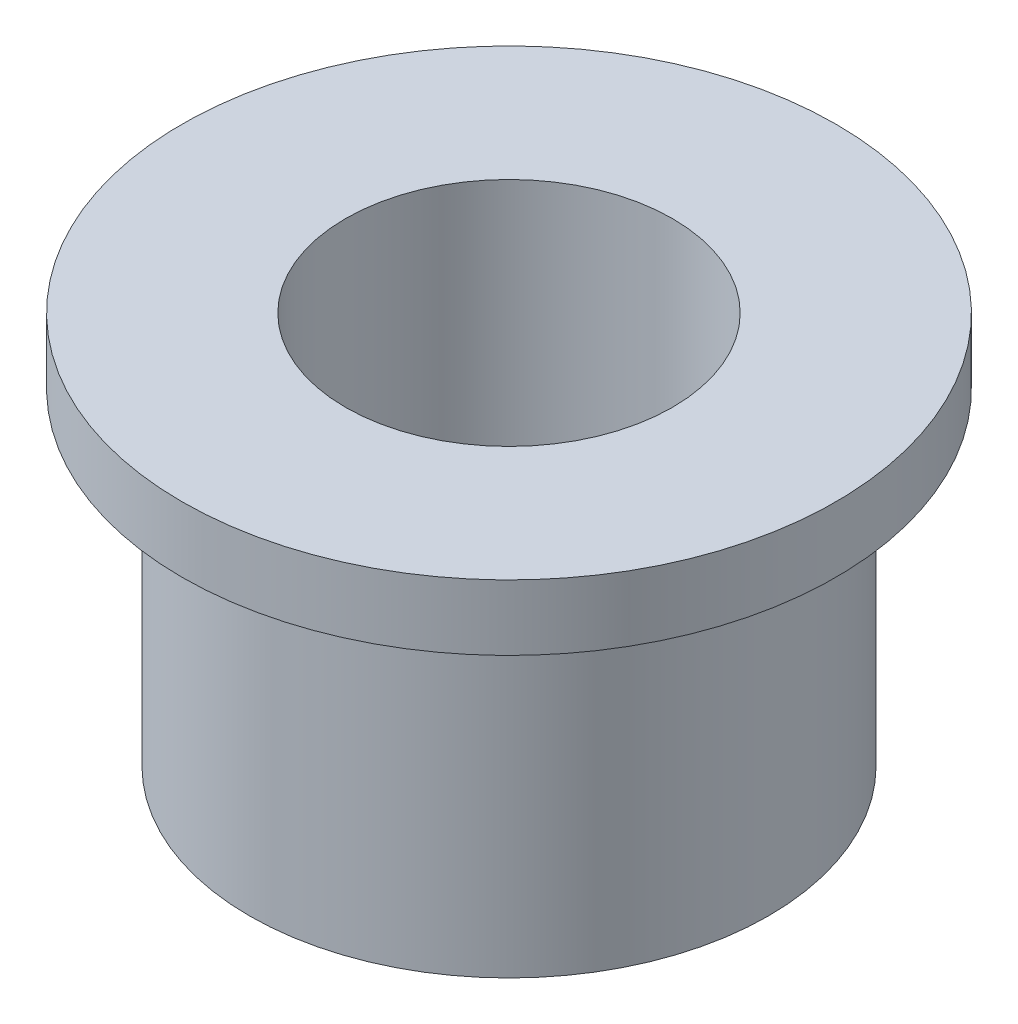
ISO-10303-21;
HEADER;
FILE_DESCRIPTION(('STEP AP214'),'2;1');
FILE_NAME('part.step','',(''),(''),'','','');
FILE_SCHEMA(('AUTOMOTIVE_DESIGN { 1 0 10303 214 1 1 1 1 }'));
ENDSEC;
DATA;
#1=APPLICATION_CONTEXT('core data for automotive mechanical design processes');
#2=APPLICATION_PROTOCOL_DEFINITION('international standard','automotive_design',2000,#1);
#3=PRODUCT_CONTEXT('',#1,'mechanical');
#4=PRODUCT('Part','Part','',(#3));
#5=PRODUCT_RELATED_PRODUCT_CATEGORY('part','',(#4));
#6=PRODUCT_DEFINITION_FORMATION('','',#4);
#7=PRODUCT_DEFINITION_CONTEXT('part definition',#1,'design');
#8=PRODUCT_DEFINITION('design','',#6,#7);
#9=PRODUCT_DEFINITION_SHAPE('','',#8);
#10=(LENGTH_UNIT() NAMED_UNIT(*) SI_UNIT(.MILLI.,.METRE.));
#11=(NAMED_UNIT(*) PLANE_ANGLE_UNIT() SI_UNIT($,.RADIAN.));
#12=(NAMED_UNIT(*) SI_UNIT($,.STERADIAN.) SOLID_ANGLE_UNIT());
#13=UNCERTAINTY_MEASURE_WITH_UNIT(LENGTH_MEASURE(1.E-05),#10,'distance_accuracy_value','');
#14=(GEOMETRIC_REPRESENTATION_CONTEXT(3) GLOBAL_UNCERTAINTY_ASSIGNED_CONTEXT((#13)) GLOBAL_UNIT_ASSIGNED_CONTEXT((#10,
#11,#12)) REPRESENTATION_CONTEXT('',''));
#15=CARTESIAN_POINT('',(0.,0.,0.));
#16=DIRECTION('',(0.,0.,1.));
#17=DIRECTION('',(1.,0.,0.));
#18=AXIS2_PLACEMENT_3D('',#15,#16,#17);
#19=CARTESIAN_POINT('',(10.,1.03225806451612,0.));
#20=DIRECTION('',(0.,-1.,0.));
#21=DIRECTION('',(0.,0.,-1.));
#22=AXIS2_PLACEMENT_3D('',#19,#20,#21);
#23=PLANE('',#22);
#24=CARTESIAN_POINT('',(0.,1.03225806451612,0.));
#25=DIRECTION('',(0.,1.,0.));
#26=DIRECTION('',(0.,0.,1.));
#27=AXIS2_PLACEMENT_3D('',#24,#25,#26);
#28=CIRCLE('',#27,5.);
#29=CARTESIAN_POINT('',(0.,1.03225806451612,5.));
#30=VERTEX_POINT('',#29);
#31=EDGE_CURVE('E10',#30,#30,#28,.T.);
#32=ORIENTED_EDGE('',*,*,#31,.F.);
#33=EDGE_LOOP('',(#32));
#34=FACE_BOUND('',#33,.T.);
#35=CARTESIAN_POINT('',(0.,1.03225806451612,0.));
#36=DIRECTION('',(0.,1.,0.));
#37=DIRECTION('',(0.,0.,1.));
#38=AXIS2_PLACEMENT_3D('',#35,#36,#37);
#39=CIRCLE('',#38,10.);
#40=CARTESIAN_POINT('',(0.,1.03225806451612,10.));
#41=VERTEX_POINT('',#40);
#42=EDGE_CURVE('E65',#41,#41,#39,.T.);
#43=ORIENTED_EDGE('',*,*,#42,.T.);
#44=EDGE_LOOP('',(#43));
#45=FACE_BOUND('',#44,.T.);
#46=ADVANCED_FACE('F36',(#34,#45),#23,.F.);
#47=CARTESIAN_POINT('',(0.,0.,0.));
#48=DIRECTION('',(0.,1.,0.));
#49=DIRECTION('',(0.,0.,1.));
#50=AXIS2_PLACEMENT_3D('',#47,#48,#49);
#51=CYLINDRICAL_SURFACE('',#50,5.);
#52=CARTESIAN_POINT('',(0.,-10.9677419354839,0.));
#53=DIRECTION('',(0.,1.,0.));
#54=DIRECTION('',(0.,0.,1.));
#55=AXIS2_PLACEMENT_3D('',#52,#53,#54);
#56=CIRCLE('',#55,5.);
#57=CARTESIAN_POINT('',(0.,-10.9677419354839,5.));
#58=VERTEX_POINT('',#57);
#59=EDGE_CURVE('E43',#58,#58,#56,.T.);
#60=ORIENTED_EDGE('',*,*,#59,.F.);
#61=EDGE_LOOP('',(#60));
#62=FACE_BOUND('',#61,.T.);
#63=ORIENTED_EDGE('',*,*,#31,.T.);
#64=EDGE_LOOP('',(#63));
#65=FACE_BOUND('',#64,.T.);
#66=ADVANCED_FACE('F92',(#62,#65),#51,.F.);
#67=CARTESIAN_POINT('',(5.,-10.9677419354839,0.));
#68=DIRECTION('',(0.,1.,0.));
#69=DIRECTION('',(0.,0.,1.));
#70=AXIS2_PLACEMENT_3D('',#67,#68,#69);
#71=PLANE('',#70);
#72=CARTESIAN_POINT('',(0.,-10.9677419354839,0.));
#73=DIRECTION('',(0.,1.,0.));
#74=DIRECTION('',(0.,0.,1.));
#75=AXIS2_PLACEMENT_3D('',#72,#73,#74);
#76=CIRCLE('',#75,7.9375);
#77=CARTESIAN_POINT('',(0.,-10.9677419354839,7.9375));
#78=VERTEX_POINT('',#77);
#79=EDGE_CURVE('E49',#78,#78,#76,.T.);
#80=ORIENTED_EDGE('',*,*,#79,.F.);
#81=EDGE_LOOP('',(#80));
#82=FACE_BOUND('',#81,.T.);
#83=ORIENTED_EDGE('',*,*,#59,.T.);
#84=EDGE_LOOP('',(#83));
#85=FACE_BOUND('',#84,.T.);
#86=ADVANCED_FACE('F87',(#82,#85),#71,.F.);
#87=CARTESIAN_POINT('',(0.,0.,0.));
#88=DIRECTION('',(0.,1.,0.));
#89=DIRECTION('',(0.,0.,1.));
#90=AXIS2_PLACEMENT_3D('',#87,#88,#89);
#91=CYLINDRICAL_SURFACE('',#90,7.9375);
#92=CARTESIAN_POINT('',(0.,-0.967741935483877,0.));
#93=DIRECTION('',(0.,1.,0.));
#94=DIRECTION('',(0.,0.,1.));
#95=AXIS2_PLACEMENT_3D('',#92,#93,#94);
#96=CIRCLE('',#95,7.9375);
#97=CARTESIAN_POINT('',(0.,-0.967741935483877,7.9375));
#98=VERTEX_POINT('',#97);
#99=EDGE_CURVE('E55',#98,#98,#96,.T.);
#100=ORIENTED_EDGE('',*,*,#99,.F.);
#101=EDGE_LOOP('',(#100));
#102=FACE_BOUND('',#101,.T.);
#103=ORIENTED_EDGE('',*,*,#79,.T.);
#104=EDGE_LOOP('',(#103));
#105=FACE_BOUND('',#104,.T.);
#106=ADVANCED_FACE('F81',(#102,#105),#91,.T.);
#107=CARTESIAN_POINT('',(7.9375,-0.967741935483877,0.));
#108=DIRECTION('',(0.,1.,0.));
#109=DIRECTION('',(0.,0.,1.));
#110=AXIS2_PLACEMENT_3D('',#107,#108,#109);
#111=PLANE('',#110);
#112=CARTESIAN_POINT('',(0.,-0.967741935483877,0.));
#113=DIRECTION('',(0.,1.,0.));
#114=DIRECTION('',(0.,0.,1.));
#115=AXIS2_PLACEMENT_3D('',#112,#113,#114);
#116=CIRCLE('',#115,10.);
#117=CARTESIAN_POINT('',(0.,-0.967741935483877,10.));
#118=VERTEX_POINT('',#117);
#119=EDGE_CURVE('E61',#118,#118,#116,.T.);
#120=ORIENTED_EDGE('',*,*,#119,.F.);
#121=EDGE_LOOP('',(#120));
#122=FACE_BOUND('',#121,.T.);
#123=ORIENTED_EDGE('',*,*,#99,.T.);
#124=EDGE_LOOP('',(#123));
#125=FACE_BOUND('',#124,.T.);
#126=ADVANCED_FACE('F75',(#122,#125),#111,.F.);
#127=CARTESIAN_POINT('',(0.,0.,0.));
#128=DIRECTION('',(0.,1.,0.));
#129=DIRECTION('',(0.,0.,1.));
#130=AXIS2_PLACEMENT_3D('',#127,#128,#129);
#131=CYLINDRICAL_SURFACE('',#130,10.);
#132=ORIENTED_EDGE('',*,*,#42,.F.);
#133=EDGE_LOOP('',(#132));
#134=FACE_BOUND('',#133,.T.);
#135=ORIENTED_EDGE('',*,*,#119,.T.);
#136=EDGE_LOOP('',(#135));
#137=FACE_BOUND('',#136,.T.);
#138=ADVANCED_FACE('F72',(#134,#137),#131,.T.);
#139=CLOSED_SHELL('',(#46,#66,#86,#106,#126,#138));
#140=MANIFOLD_SOLID_BREP('B2',#139);
#141=ADVANCED_BREP_SHAPE_REPRESENTATION('',(#18,#140),#14);
#142=SHAPE_DEFINITION_REPRESENTATION(#9,#141);
ENDSEC;
END-ISO-10303-21;
